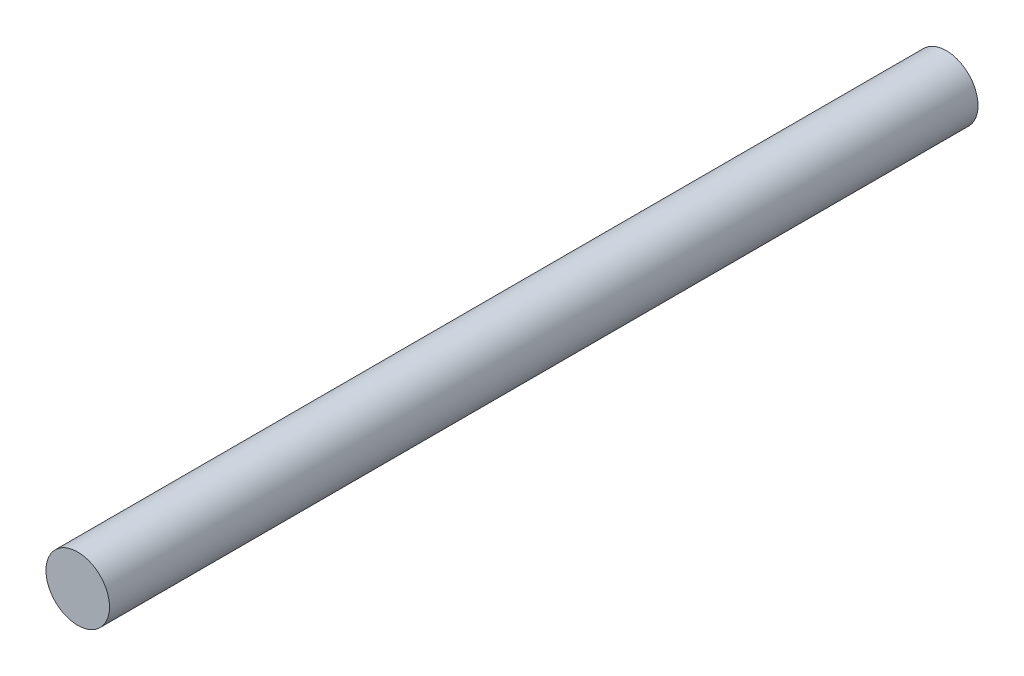
ISO-10303-21;
HEADER;
FILE_DESCRIPTION(('STEP AP214'),'2;1');
FILE_NAME('part.step','',(''),(''),'','','');
FILE_SCHEMA(('AUTOMOTIVE_DESIGN { 1 0 10303 214 1 1 1 1 }'));
ENDSEC;
DATA;
#1=APPLICATION_CONTEXT('core data for automotive mechanical design processes');
#2=APPLICATION_PROTOCOL_DEFINITION('international standard','automotive_design',2000,#1);
#3=PRODUCT_CONTEXT('',#1,'mechanical');
#4=PRODUCT('Part','Part','',(#3));
#5=PRODUCT_RELATED_PRODUCT_CATEGORY('part','',(#4));
#6=PRODUCT_DEFINITION_FORMATION('','',#4);
#7=PRODUCT_DEFINITION_CONTEXT('part definition',#1,'design');
#8=PRODUCT_DEFINITION('design','',#6,#7);
#9=PRODUCT_DEFINITION_SHAPE('','',#8);
#10=(LENGTH_UNIT() NAMED_UNIT(*) SI_UNIT(.MILLI.,.METRE.));
#11=(NAMED_UNIT(*) PLANE_ANGLE_UNIT() SI_UNIT($,.RADIAN.));
#12=(NAMED_UNIT(*) SI_UNIT($,.STERADIAN.) SOLID_ANGLE_UNIT());
#13=UNCERTAINTY_MEASURE_WITH_UNIT(LENGTH_MEASURE(1.E-05),#10,'distance_accuracy_value','');
#14=(GEOMETRIC_REPRESENTATION_CONTEXT(3) GLOBAL_UNCERTAINTY_ASSIGNED_CONTEXT((#13)) GLOBAL_UNIT_ASSIGNED_CONTEXT((#10,
#11,#12)) REPRESENTATION_CONTEXT('',''));
#15=CARTESIAN_POINT('',(0.,0.,0.));
#16=DIRECTION('',(0.,0.,1.));
#17=DIRECTION('',(1.,0.,0.));
#18=AXIS2_PLACEMENT_3D('',#15,#16,#17);
#19=CARTESIAN_POINT('',(0.,0.,82.));
#20=DIRECTION('',(0.,0.,-1.));
#21=DIRECTION('',(-1.,0.,0.));
#22=AXIS2_PLACEMENT_3D('',#19,#20,#21);
#23=CYLINDRICAL_SURFACE('',#22,3.);
#24=CARTESIAN_POINT('',(0.,0.,82.));
#25=DIRECTION('',(0.,0.,1.));
#26=DIRECTION('',(1.,0.,0.));
#27=AXIS2_PLACEMENT_3D('',#24,#25,#26);
#28=CIRCLE('',#27,3.);
#29=CARTESIAN_POINT('',(3.,0.,82.));
#30=VERTEX_POINT('',#29);
#31=EDGE_CURVE('E10',#30,#30,#28,.T.);
#32=ORIENTED_EDGE('',*,*,#31,.F.);
#33=EDGE_LOOP('',(#32));
#34=FACE_BOUND('',#33,.T.);
#35=CARTESIAN_POINT('',(0.,0.,0.));
#36=DIRECTION('',(0.,0.,1.));
#37=DIRECTION('',(1.,0.,0.));
#38=AXIS2_PLACEMENT_3D('',#35,#36,#37);
#39=CIRCLE('',#38,3.);
#40=CARTESIAN_POINT('',(3.,0.,0.));
#41=VERTEX_POINT('',#40);
#42=EDGE_CURVE('E40',#41,#41,#39,.T.);
#43=ORIENTED_EDGE('',*,*,#42,.T.);
#44=EDGE_LOOP('',(#43));
#45=FACE_BOUND('',#44,.T.);
#46=ADVANCED_FACE('F37',(#34,#45),#23,.T.);
#47=CARTESIAN_POINT('',(0.,0.,82.));
#48=DIRECTION('',(0.,0.,1.));
#49=DIRECTION('',(1.,0.,0.));
#50=AXIS2_PLACEMENT_3D('',#47,#48,#49);
#51=PLANE('',#50);
#52=ORIENTED_EDGE('',*,*,#31,.T.);
#53=EDGE_LOOP('',(#52));
#54=FACE_BOUND('',#53,.T.);
#55=ADVANCED_FACE('F54',(#54),#51,.T.);
#56=CARTESIAN_POINT('',(0.,0.,0.));
#57=DIRECTION('',(0.,0.,1.));
#58=DIRECTION('',(1.,0.,0.));
#59=AXIS2_PLACEMENT_3D('',#56,#57,#58);
#60=PLANE('',#59);
#61=ORIENTED_EDGE('',*,*,#42,.F.);
#62=EDGE_LOOP('',(#61));
#63=FACE_BOUND('',#62,.T.);
#64=ADVANCED_FACE('F52',(#63),#60,.F.);
#65=CLOSED_SHELL('',(#46,#55,#64));
#66=MANIFOLD_SOLID_BREP('B2',#65);
#67=ADVANCED_BREP_SHAPE_REPRESENTATION('',(#18,#66),#14);
#68=SHAPE_DEFINITION_REPRESENTATION(#9,#67);
ENDSEC;
END-ISO-10303-21;
